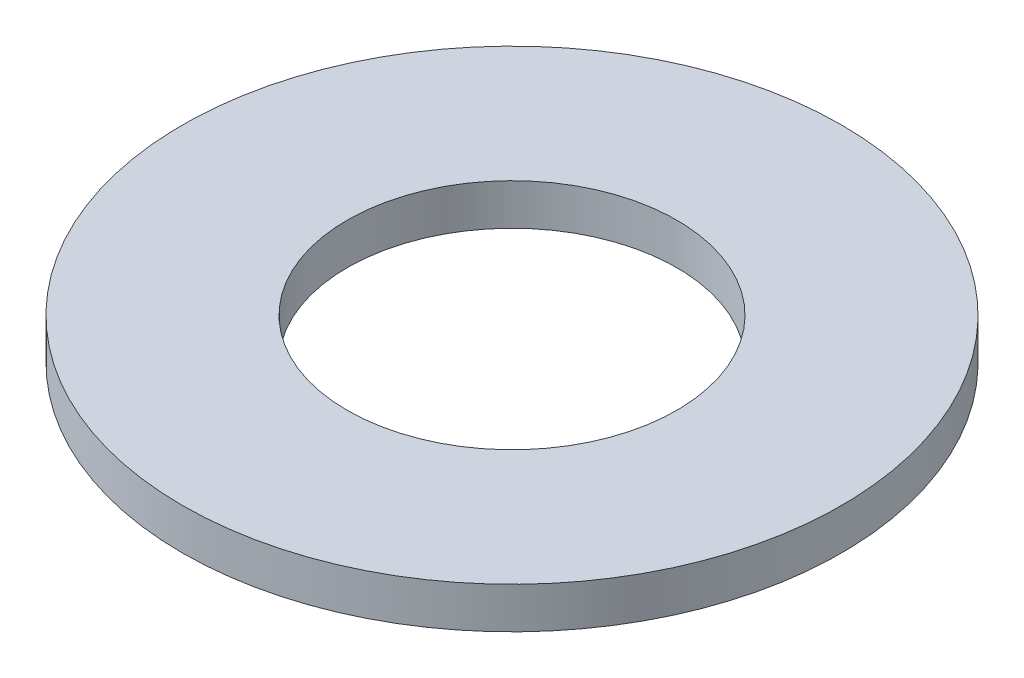
ISO-10303-21;
HEADER;
FILE_DESCRIPTION(('STEP AP214'),'2;1');
FILE_NAME('part.step','',(''),(''),'','','');
FILE_SCHEMA(('AUTOMOTIVE_DESIGN { 1 0 10303 214 1 1 1 1 }'));
ENDSEC;
DATA;
#1=APPLICATION_CONTEXT('core data for automotive mechanical design processes');
#2=APPLICATION_PROTOCOL_DEFINITION('international standard','automotive_design',2000,#1);
#3=PRODUCT_CONTEXT('',#1,'mechanical');
#4=PRODUCT('Part','Part','',(#3));
#5=PRODUCT_RELATED_PRODUCT_CATEGORY('part','',(#4));
#6=PRODUCT_DEFINITION_FORMATION('','',#4);
#7=PRODUCT_DEFINITION_CONTEXT('part definition',#1,'design');
#8=PRODUCT_DEFINITION('design','',#6,#7);
#9=PRODUCT_DEFINITION_SHAPE('','',#8);
#10=(LENGTH_UNIT() NAMED_UNIT(*) SI_UNIT(.MILLI.,.METRE.));
#11=(NAMED_UNIT(*) PLANE_ANGLE_UNIT() SI_UNIT($,.RADIAN.));
#12=(NAMED_UNIT(*) SI_UNIT($,.STERADIAN.) SOLID_ANGLE_UNIT());
#13=UNCERTAINTY_MEASURE_WITH_UNIT(LENGTH_MEASURE(1.E-05),#10,'distance_accuracy_value','');
#14=(GEOMETRIC_REPRESENTATION_CONTEXT(3) GLOBAL_UNCERTAINTY_ASSIGNED_CONTEXT((#13)) GLOBAL_UNIT_ASSIGNED_CONTEXT((#10,
#11,#12)) REPRESENTATION_CONTEXT('',''));
#15=CARTESIAN_POINT('',(0.,0.,0.));
#16=DIRECTION('',(0.,0.,1.));
#17=DIRECTION('',(1.,0.,0.));
#18=AXIS2_PLACEMENT_3D('',#15,#16,#17);
#19=CARTESIAN_POINT('',(0.,0.79375,0.));
#20=DIRECTION('',(0.,1.,0.));
#21=DIRECTION('',(0.,0.,1.));
#22=AXIS2_PLACEMENT_3D('',#19,#20,#21);
#23=PLANE('',#22);
#24=CARTESIAN_POINT('',(0.,0.79375,0.));
#25=DIRECTION('',(0.,1.,0.));
#26=DIRECTION('',(0.,0.,1.));
#27=AXIS2_PLACEMENT_3D('',#24,#25,#26);
#28=CIRCLE('',#27,6.35);
#29=CARTESIAN_POINT('',(0.,0.79375,6.35));
#30=VERTEX_POINT('',#29);
#31=EDGE_CURVE('E10',#30,#30,#28,.T.);
#32=ORIENTED_EDGE('',*,*,#31,.T.);
#33=EDGE_LOOP('',(#32));
#34=FACE_BOUND('',#33,.T.);
#35=CARTESIAN_POINT('',(0.,0.79375,0.));
#36=DIRECTION('',(0.,1.,0.));
#37=DIRECTION('',(0.,0.,1.));
#38=AXIS2_PLACEMENT_3D('',#35,#36,#37);
#39=CIRCLE('',#38,3.175);
#40=CARTESIAN_POINT('',(0.,0.79375,3.175));
#41=VERTEX_POINT('',#40);
#42=EDGE_CURVE('E42',#41,#41,#39,.T.);
#43=ORIENTED_EDGE('',*,*,#42,.F.);
#44=EDGE_LOOP('',(#43));
#45=FACE_BOUND('',#44,.T.);
#46=ADVANCED_FACE('F31',(#34,#45),#23,.T.);
#47=CARTESIAN_POINT('',(0.,0.,0.));
#48=DIRECTION('',(0.,1.,0.));
#49=DIRECTION('',(0.,0.,1.));
#50=AXIS2_PLACEMENT_3D('',#47,#48,#49);
#51=PLANE('',#50);
#52=CARTESIAN_POINT('',(0.,0.,0.));
#53=DIRECTION('',(0.,1.,0.));
#54=DIRECTION('',(0.,0.,1.));
#55=AXIS2_PLACEMENT_3D('',#52,#53,#54);
#56=CIRCLE('',#55,6.35);
#57=CARTESIAN_POINT('',(0.,0.,6.35));
#58=VERTEX_POINT('',#57);
#59=EDGE_CURVE('E35',#58,#58,#56,.T.);
#60=ORIENTED_EDGE('',*,*,#59,.F.);
#61=EDGE_LOOP('',(#60));
#62=FACE_BOUND('',#61,.T.);
#63=CARTESIAN_POINT('',(0.,0.,0.));
#64=DIRECTION('',(0.,1.,0.));
#65=DIRECTION('',(0.,0.,1.));
#66=AXIS2_PLACEMENT_3D('',#63,#64,#65);
#67=CIRCLE('',#66,3.175);
#68=CARTESIAN_POINT('',(0.,0.,3.175));
#69=VERTEX_POINT('',#68);
#70=EDGE_CURVE('E44',#69,#69,#67,.T.);
#71=ORIENTED_EDGE('',*,*,#70,.T.);
#72=EDGE_LOOP('',(#71));
#73=FACE_BOUND('',#72,.T.);
#74=ADVANCED_FACE('F54',(#62,#73),#51,.F.);
#75=CARTESIAN_POINT('',(0.,0.79375,0.));
#76=DIRECTION('',(0.,-1.,0.));
#77=DIRECTION('',(0.,0.,-1.));
#78=AXIS2_PLACEMENT_3D('',#75,#76,#77);
#79=CYLINDRICAL_SURFACE('',#78,6.35);
#80=ORIENTED_EDGE('',*,*,#31,.F.);
#81=EDGE_LOOP('',(#80));
#82=FACE_BOUND('',#81,.T.);
#83=ORIENTED_EDGE('',*,*,#59,.T.);
#84=EDGE_LOOP('',(#83));
#85=FACE_BOUND('',#84,.T.);
#86=ADVANCED_FACE('F33',(#82,#85),#79,.T.);
#87=CARTESIAN_POINT('',(0.,0.79375,0.));
#88=DIRECTION('',(0.,-1.,0.));
#89=DIRECTION('',(0.,0.,-1.));
#90=AXIS2_PLACEMENT_3D('',#87,#88,#89);
#91=CYLINDRICAL_SURFACE('',#90,3.175);
#92=ORIENTED_EDGE('',*,*,#42,.T.);
#93=EDGE_LOOP('',(#92));
#94=FACE_BOUND('',#93,.T.);
#95=ORIENTED_EDGE('',*,*,#70,.F.);
#96=EDGE_LOOP('',(#95));
#97=FACE_BOUND('',#96,.T.);
#98=ADVANCED_FACE('F50',(#94,#97),#91,.F.);
#99=CLOSED_SHELL('',(#46,#74,#86,#98));
#100=MANIFOLD_SOLID_BREP('B2',#99);
#101=ADVANCED_BREP_SHAPE_REPRESENTATION('',(#18,#100),#14);
#102=SHAPE_DEFINITION_REPRESENTATION(#9,#101);
ENDSEC;
END-ISO-10303-21;
